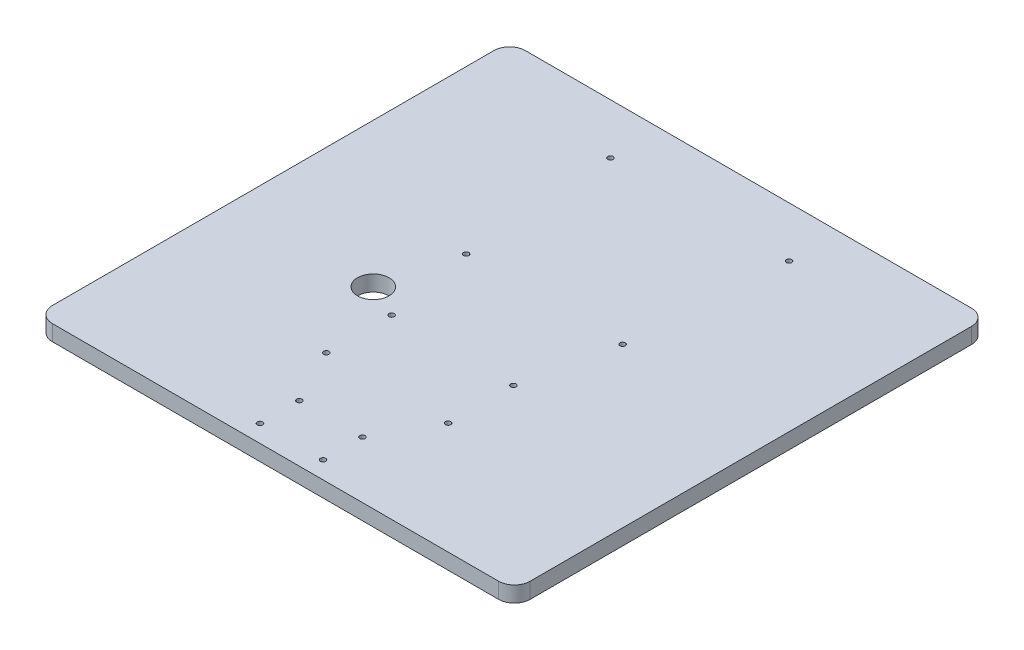
ISO-10303-21;
HEADER;
FILE_DESCRIPTION(('STEP AP214'),'2;1');
FILE_NAME('part.step','',(''),(''),'','','');
FILE_SCHEMA(('AUTOMOTIVE_DESIGN { 1 0 10303 214 1 1 1 1 }'));
ENDSEC;
DATA;
#1=APPLICATION_CONTEXT('core data for automotive mechanical design processes');
#2=APPLICATION_PROTOCOL_DEFINITION('international standard','automotive_design',2000,#1);
#3=PRODUCT_CONTEXT('',#1,'mechanical');
#4=PRODUCT('Part','Part','',(#3));
#5=PRODUCT_RELATED_PRODUCT_CATEGORY('part','',(#4));
#6=PRODUCT_DEFINITION_FORMATION('','',#4);
#7=PRODUCT_DEFINITION_CONTEXT('part definition',#1,'design');
#8=PRODUCT_DEFINITION('design','',#6,#7);
#9=PRODUCT_DEFINITION_SHAPE('','',#8);
#10=(LENGTH_UNIT() NAMED_UNIT(*) SI_UNIT(.MILLI.,.METRE.));
#11=(NAMED_UNIT(*) PLANE_ANGLE_UNIT() SI_UNIT($,.RADIAN.));
#12=(NAMED_UNIT(*) SI_UNIT($,.STERADIAN.) SOLID_ANGLE_UNIT());
#13=UNCERTAINTY_MEASURE_WITH_UNIT(LENGTH_MEASURE(1.E-05),#10,'distance_accuracy_value','');
#14=(GEOMETRIC_REPRESENTATION_CONTEXT(3) GLOBAL_UNCERTAINTY_ASSIGNED_CONTEXT((#13)) GLOBAL_UNIT_ASSIGNED_CONTEXT((#10,
#11,#12)) REPRESENTATION_CONTEXT('',''));
#15=CARTESIAN_POINT('',(0.,0.,0.));
#16=DIRECTION('',(0.,0.,1.));
#17=DIRECTION('',(1.,0.,0.));
#18=AXIS2_PLACEMENT_3D('',#15,#16,#17);
#19=CARTESIAN_POINT('',(0.,-10.,0.));
#20=DIRECTION('',(-1.,0.,0.));
#21=DIRECTION('',(0.,0.,1.));
#22=AXIS2_PLACEMENT_3D('',#19,#20,#21);
#23=PLANE('',#22);
#24=DIRECTION('',(0.,0.,1.));
#25=VECTOR('',#24,1.);
#26=CARTESIAN_POINT('',(0.,-10.,0.));
#27=LINE('',#26,#25);
#28=CARTESIAN_POINT('',(0.,-10.,-290.));
#29=VERTEX_POINT('',#28);
#30=CARTESIAN_POINT('',(0.,-10.,-10.));
#31=VERTEX_POINT('',#30);
#32=EDGE_CURVE('E161',#29,#31,#27,.T.);
#33=ORIENTED_EDGE('',*,*,#32,.T.);
#34=DIRECTION('',(0.,1.,0.));
#35=VECTOR('',#34,1.);
#36=CARTESIAN_POINT('',(0.,-10.,-10.));
#37=LINE('',#36,#35);
#38=CARTESIAN_POINT('',(0.,0.,-10.));
#39=VERTEX_POINT('',#38);
#40=EDGE_CURVE('E154',#31,#39,#37,.T.);
#41=ORIENTED_EDGE('',*,*,#40,.T.);
#42=DIRECTION('',(0.,0.,1.));
#43=VECTOR('',#42,1.);
#44=CARTESIAN_POINT('',(0.,0.,0.));
#45=LINE('',#44,#43);
#46=CARTESIAN_POINT('',(0.,0.,-290.));
#47=VERTEX_POINT('',#46);
#48=EDGE_CURVE('E107',#47,#39,#45,.T.);
#49=ORIENTED_EDGE('',*,*,#48,.F.);
#50=DIRECTION('',(0.,1.,0.));
#51=VECTOR('',#50,1.);
#52=CARTESIAN_POINT('',(0.,-10.,-290.));
#53=LINE('',#52,#51);
#54=EDGE_CURVE('E152',#47,#29,#53,.F.);
#55=ORIENTED_EDGE('',*,*,#54,.T.);
#56=EDGE_LOOP('',(#33,#41,#49,#55));
#57=FACE_BOUND('',#56,.T.);
#58=ADVANCED_FACE('F37',(#57),#23,.T.);
#59=CARTESIAN_POINT('',(0.,-10.,-300.));
#60=DIRECTION('',(0.,0.,-1.));
#61=DIRECTION('',(-1.,0.,0.));
#62=AXIS2_PLACEMENT_3D('',#59,#60,#61);
#63=PLANE('',#62);
#64=DIRECTION('',(-1.,0.,0.));
#65=VECTOR('',#64,1.);
#66=CARTESIAN_POINT('',(0.,0.,-300.));
#67=LINE('',#66,#65);
#68=CARTESIAN_POINT('',(293.,0.,-300.));
#69=VERTEX_POINT('',#68);
#70=CARTESIAN_POINT('',(10.,0.,-300.));
#71=VERTEX_POINT('',#70);
#72=EDGE_CURVE('E135',#69,#71,#67,.T.);
#73=ORIENTED_EDGE('',*,*,#72,.F.);
#74=DIRECTION('',(0.,1.,0.));
#75=VECTOR('',#74,1.);
#76=CARTESIAN_POINT('',(293.,-10.,-300.));
#77=LINE('',#76,#75);
#78=CARTESIAN_POINT('',(293.,-10.,-300.));
#79=VERTEX_POINT('',#78);
#80=EDGE_CURVE('E11',#69,#79,#77,.F.);
#81=ORIENTED_EDGE('',*,*,#80,.T.);
#82=DIRECTION('',(-1.,0.,0.));
#83=VECTOR('',#82,1.);
#84=CARTESIAN_POINT('',(0.,-10.,-300.));
#85=LINE('',#84,#83);
#86=CARTESIAN_POINT('',(10.,-10.,-300.));
#87=VERTEX_POINT('',#86);
#88=EDGE_CURVE('E128',#79,#87,#85,.T.);
#89=ORIENTED_EDGE('',*,*,#88,.T.);
#90=DIRECTION('',(0.,1.,0.));
#91=VECTOR('',#90,1.);
#92=CARTESIAN_POINT('',(10.,-10.,-300.));
#93=LINE('',#92,#91);
#94=EDGE_CURVE('E45',#87,#71,#93,.T.);
#95=ORIENTED_EDGE('',*,*,#94,.T.);
#96=EDGE_LOOP('',(#73,#81,#89,#95));
#97=FACE_BOUND('',#96,.T.);
#98=ADVANCED_FACE('F158',(#97),#63,.T.);
#99=CARTESIAN_POINT('',(303.,-10.,0.));
#100=DIRECTION('',(1.,0.,0.));
#101=DIRECTION('',(0.,0.,-1.));
#102=AXIS2_PLACEMENT_3D('',#99,#100,#101);
#103=PLANE('',#102);
#104=DIRECTION('',(0.,0.,-1.));
#105=VECTOR('',#104,1.);
#106=CARTESIAN_POINT('',(303.,0.,0.));
#107=LINE('',#106,#105);
#108=CARTESIAN_POINT('',(303.,0.,-10.));
#109=VERTEX_POINT('',#108);
#110=CARTESIAN_POINT('',(303.,0.,-290.));
#111=VERTEX_POINT('',#110);
#112=EDGE_CURVE('E123',#109,#111,#107,.T.);
#113=ORIENTED_EDGE('',*,*,#112,.F.);
#114=DIRECTION('',(0.,1.,0.));
#115=VECTOR('',#114,1.);
#116=CARTESIAN_POINT('',(303.,-10.,-10.));
#117=LINE('',#116,#115);
#118=CARTESIAN_POINT('',(303.,-10.,-10.));
#119=VERTEX_POINT('',#118);
#120=EDGE_CURVE('E144',#109,#119,#117,.F.);
#121=ORIENTED_EDGE('',*,*,#120,.T.);
#122=DIRECTION('',(0.,0.,-1.));
#123=VECTOR('',#122,1.);
#124=CARTESIAN_POINT('',(303.,-10.,0.));
#125=LINE('',#124,#123);
#126=CARTESIAN_POINT('',(303.,-10.,-290.));
#127=VERTEX_POINT('',#126);
#128=EDGE_CURVE('E132',#119,#127,#125,.T.);
#129=ORIENTED_EDGE('',*,*,#128,.T.);
#130=DIRECTION('',(0.,1.,0.));
#131=VECTOR('',#130,1.);
#132=CARTESIAN_POINT('',(303.,-10.,-290.));
#133=LINE('',#132,#131);
#134=EDGE_CURVE('E141',#127,#111,#133,.T.);
#135=ORIENTED_EDGE('',*,*,#134,.T.);
#136=EDGE_LOOP('',(#113,#121,#129,#135));
#137=FACE_BOUND('',#136,.T.);
#138=ADVANCED_FACE('F301',(#137),#103,.T.);
#139=CARTESIAN_POINT('',(0.,-10.,0.));
#140=DIRECTION('',(0.,0.,1.));
#141=DIRECTION('',(1.,0.,0.));
#142=AXIS2_PLACEMENT_3D('',#139,#140,#141);
#143=PLANE('',#142);
#144=DIRECTION('',(1.,0.,0.));
#145=VECTOR('',#144,1.);
#146=CARTESIAN_POINT('',(0.,-10.,0.));
#147=LINE('',#146,#145);
#148=CARTESIAN_POINT('',(10.,-10.,0.));
#149=VERTEX_POINT('',#148);
#150=CARTESIAN_POINT('',(293.,-10.,0.));
#151=VERTEX_POINT('',#150);
#152=EDGE_CURVE('E163',#149,#151,#147,.T.);
#153=ORIENTED_EDGE('',*,*,#152,.T.);
#154=DIRECTION('',(0.,1.,0.));
#155=VECTOR('',#154,1.);
#156=CARTESIAN_POINT('',(293.,-10.,0.));
#157=LINE('',#156,#155);
#158=CARTESIAN_POINT('',(293.,0.,0.));
#159=VERTEX_POINT('',#158);
#160=EDGE_CURVE('E122',#151,#159,#157,.T.);
#161=ORIENTED_EDGE('',*,*,#160,.T.);
#162=DIRECTION('',(1.,0.,0.));
#163=VECTOR('',#162,1.);
#164=CARTESIAN_POINT('',(0.,0.,0.));
#165=LINE('',#164,#163);
#166=CARTESIAN_POINT('',(10.,0.,0.));
#167=VERTEX_POINT('',#166);
#168=EDGE_CURVE('E105',#167,#159,#165,.T.);
#169=ORIENTED_EDGE('',*,*,#168,.F.);
#170=DIRECTION('',(0.,1.,0.));
#171=VECTOR('',#170,1.);
#172=CARTESIAN_POINT('',(10.,-10.,0.));
#173=LINE('',#172,#171);
#174=EDGE_CURVE('E119',#167,#149,#173,.F.);
#175=ORIENTED_EDGE('',*,*,#174,.T.);
#176=EDGE_LOOP('',(#153,#161,#169,#175));
#177=FACE_BOUND('',#176,.T.);
#178=ADVANCED_FACE('F118',(#177),#143,.T.);
#179=CARTESIAN_POINT('',(0.,-10.,0.));
#180=DIRECTION('',(0.,-1.,0.));
#181=DIRECTION('',(0.,0.,-1.));
#182=AXIS2_PLACEMENT_3D('',#179,#180,#181);
#183=PLANE('',#182);
#184=CARTESIAN_POINT('',(190.149999999997,-10.,-70.8519999999986));
#185=DIRECTION('',(0.,-1.,0.));
#186=DIRECTION('',(0.,0.,-1.));
#187=AXIS2_PLACEMENT_3D('',#184,#185,#186);
#188=CIRCLE('',#187,1.69999999999998);
#189=CARTESIAN_POINT('',(190.149999999997,-10.,-72.5519999999986));
#190=VERTEX_POINT('',#189);
#191=EDGE_CURVE('E243',#190,#190,#188,.T.);
#192=ORIENTED_EDGE('',*,*,#191,.F.);
#193=EDGE_LOOP('',(#192));
#194=FACE_BOUND('',#193,.T.);
#195=CARTESIAN_POINT('',(190.149999999998,-10.,-112.247999999999));
#196=DIRECTION('',(0.,-1.,0.));
#197=DIRECTION('',(0.,0.,-1.));
#198=AXIS2_PLACEMENT_3D('',#195,#196,#197);
#199=CIRCLE('',#198,1.69999999999998);
#200=CARTESIAN_POINT('',(190.149999999998,-10.,-113.947999999999));
#201=VERTEX_POINT('',#200);
#202=EDGE_CURVE('E237',#201,#201,#199,.T.);
#203=ORIENTED_EDGE('',*,*,#202,.F.);
#204=EDGE_LOOP('',(#203));
#205=FACE_BOUND('',#204,.T.);
#206=CARTESIAN_POINT('',(112.859999999997,-10.,-70.8519999999991));
#207=DIRECTION('',(0.,-1.,0.));
#208=DIRECTION('',(0.,0.,-1.));
#209=AXIS2_PLACEMENT_3D('',#206,#207,#208);
#210=CIRCLE('',#209,1.69999999999999);
#211=CARTESIAN_POINT('',(112.859999999997,-10.,-72.5519999999991));
#212=VERTEX_POINT('',#211);
#213=EDGE_CURVE('E231',#212,#212,#210,.T.);
#214=ORIENTED_EDGE('',*,*,#213,.F.);
#215=EDGE_LOOP('',(#214));
#216=FACE_BOUND('',#215,.T.);
#217=CARTESIAN_POINT('',(112.859999999997,-10.,-112.248));
#218=DIRECTION('',(0.,-1.,0.));
#219=DIRECTION('',(0.,0.,-1.));
#220=AXIS2_PLACEMENT_3D('',#217,#218,#219);
#221=CIRCLE('',#220,1.69999999999999);
#222=CARTESIAN_POINT('',(112.859999999997,-10.,-113.948));
#223=VERTEX_POINT('',#222);
#224=EDGE_CURVE('E223',#223,#223,#221,.T.);
#225=ORIENTED_EDGE('',*,*,#224,.F.);
#226=EDGE_LOOP('',(#225));
#227=FACE_BOUND('',#226,.T.);
#228=CARTESIAN_POINT('',(91.5,-10.,-122.));
#229=DIRECTION('',(0.,1.,0.));
#230=DIRECTION('',(0.,0.,1.));
#231=AXIS2_PLACEMENT_3D('',#228,#229,#230);
#232=CIRCLE('',#231,9.99999999999998);
#233=CARTESIAN_POINT('',(91.5,-10.,-112.));
#234=VERTEX_POINT('',#233);
#235=EDGE_CURVE('E219',#234,#234,#232,.T.);
#236=ORIENTED_EDGE('',*,*,#235,.T.);
#237=EDGE_LOOP('',(#236));
#238=FACE_BOUND('',#237,.T.);
#239=CARTESIAN_POINT('',(130.625,-10.,-11.));
#240=DIRECTION('',(0.,-1.,0.));
#241=DIRECTION('',(0.,0.,-1.));
#242=AXIS2_PLACEMENT_3D('',#239,#240,#241);
#243=CIRCLE('',#242,1.69999999999998);
#244=CARTESIAN_POINT('',(130.625,-10.,-12.7));
#245=VERTEX_POINT('',#244);
#246=EDGE_CURVE('E213',#245,#245,#243,.T.);
#247=ORIENTED_EDGE('',*,*,#246,.F.);
#248=EDGE_LOOP('',(#247));
#249=FACE_BOUND('',#248,.T.);
#250=CARTESIAN_POINT('',(170.625,-10.,-11.));
#251=DIRECTION('',(0.,-1.,0.));
#252=DIRECTION('',(0.,0.,-1.));
#253=AXIS2_PLACEMENT_3D('',#250,#251,#252);
#254=CIRCLE('',#253,1.69999999999998);
#255=CARTESIAN_POINT('',(170.625,-10.,-12.7));
#256=VERTEX_POINT('',#255);
#257=EDGE_CURVE('E207',#256,#256,#254,.T.);
#258=ORIENTED_EDGE('',*,*,#257,.F.);
#259=EDGE_LOOP('',(#258));
#260=FACE_BOUND('',#259,.T.);
#261=CARTESIAN_POINT('',(130.625,-10.,-36.));
#262=DIRECTION('',(0.,-1.,0.));
#263=DIRECTION('',(0.,0.,-1.));
#264=AXIS2_PLACEMENT_3D('',#261,#262,#263);
#265=CIRCLE('',#264,1.69999999999998);
#266=CARTESIAN_POINT('',(130.625,-10.,-37.7));
#267=VERTEX_POINT('',#266);
#268=EDGE_CURVE('E201',#267,#267,#265,.T.);
#269=ORIENTED_EDGE('',*,*,#268,.F.);
#270=EDGE_LOOP('',(#269));
#271=FACE_BOUND('',#270,.T.);
#272=CARTESIAN_POINT('',(170.625,-10.,-36.));
#273=DIRECTION('',(0.,-1.,0.));
#274=DIRECTION('',(0.,0.,-1.));
#275=AXIS2_PLACEMENT_3D('',#272,#273,#274);
#276=CIRCLE('',#275,1.69999999999998);
#277=CARTESIAN_POINT('',(170.625,-10.,-37.7));
#278=VERTEX_POINT('',#277);
#279=EDGE_CURVE('E195',#278,#278,#276,.T.);
#280=ORIENTED_EDGE('',*,*,#279,.F.);
#281=EDGE_LOOP('',(#280));
#282=FACE_BOUND('',#281,.T.);
#283=CARTESIAN_POINT('',(202.2366,-10.,-169.469739332807));
#284=DIRECTION('',(0.,-1.,0.));
#285=DIRECTION('',(0.,0.,-1.));
#286=AXIS2_PLACEMENT_3D('',#283,#284,#285);
#287=CIRCLE('',#286,1.69999999999998);
#288=CARTESIAN_POINT('',(202.2366,-10.,-171.169739332807));
#289=VERTEX_POINT('',#288);
#290=EDGE_CURVE('E189',#289,#289,#287,.T.);
#291=ORIENTED_EDGE('',*,*,#290,.F.);
#292=EDGE_LOOP('',(#291));
#293=FACE_BOUND('',#292,.T.);
#294=CARTESIAN_POINT('',(102.9732,-10.,-169.469739332807));
#295=DIRECTION('',(0.,-1.,0.));
#296=DIRECTION('',(0.,0.,-1.));
#297=AXIS2_PLACEMENT_3D('',#294,#295,#296);
#298=CIRCLE('',#297,1.69999999999999);
#299=CARTESIAN_POINT('',(102.9732,-10.,-171.169739332807));
#300=VERTEX_POINT('',#299);
#301=EDGE_CURVE('E183',#300,#300,#298,.T.);
#302=ORIENTED_EDGE('',*,*,#301,.F.);
#303=EDGE_LOOP('',(#302));
#304=FACE_BOUND('',#303,.T.);
#305=CARTESIAN_POINT('',(95.9732,-10.,-267.996539332807));
#306=DIRECTION('',(0.,-1.,0.));
#307=DIRECTION('',(0.,0.,-1.));
#308=AXIS2_PLACEMENT_3D('',#305,#306,#307);
#309=CIRCLE('',#308,1.69999999999999);
#310=CARTESIAN_POINT('',(95.9732,-10.,-269.696539332807));
#311=VERTEX_POINT('',#310);
#312=EDGE_CURVE('E177',#311,#311,#309,.T.);
#313=ORIENTED_EDGE('',*,*,#312,.F.);
#314=EDGE_LOOP('',(#313));
#315=FACE_BOUND('',#314,.T.);
#316=CARTESIAN_POINT('',(209.2366,-10.,-267.996539332807));
#317=DIRECTION('',(0.,-1.,0.));
#318=DIRECTION('',(0.,0.,-1.));
#319=AXIS2_PLACEMENT_3D('',#316,#317,#318);
#320=CIRCLE('',#319,1.69999999999998);
#321=CARTESIAN_POINT('',(209.2366,-10.,-269.696539332807));
#322=VERTEX_POINT('',#321);
#323=EDGE_CURVE('E167',#322,#322,#320,.T.);
#324=ORIENTED_EDGE('',*,*,#323,.F.);
#325=EDGE_LOOP('',(#324));
#326=FACE_BOUND('',#325,.T.);
#327=ORIENTED_EDGE('',*,*,#128,.F.);
#328=CARTESIAN_POINT('',(293.,-10.,-10.));
#329=DIRECTION('',(0.,-1.,0.));
#330=DIRECTION('',(0.,0.,-1.));
#331=AXIS2_PLACEMENT_3D('',#328,#329,#330);
#332=CIRCLE('',#331,10.);
#333=EDGE_CURVE('E150',#119,#151,#332,.T.);
#334=ORIENTED_EDGE('',*,*,#333,.T.);
#335=ORIENTED_EDGE('',*,*,#152,.F.);
#336=CARTESIAN_POINT('',(10.,-10.,-10.));
#337=DIRECTION('',(0.,-1.,0.));
#338=DIRECTION('',(0.,0.,-1.));
#339=AXIS2_PLACEMENT_3D('',#336,#337,#338);
#340=CIRCLE('',#339,10.);
#341=EDGE_CURVE('E127',#149,#31,#340,.T.);
#342=ORIENTED_EDGE('',*,*,#341,.T.);
#343=ORIENTED_EDGE('',*,*,#32,.F.);
#344=CARTESIAN_POINT('',(10.,-10.,-290.));
#345=DIRECTION('',(0.,-1.,0.));
#346=DIRECTION('',(0.,0.,-1.));
#347=AXIS2_PLACEMENT_3D('',#344,#345,#346);
#348=CIRCLE('',#347,10.);
#349=EDGE_CURVE('E52',#29,#87,#348,.T.);
#350=ORIENTED_EDGE('',*,*,#349,.T.);
#351=ORIENTED_EDGE('',*,*,#88,.F.);
#352=CARTESIAN_POINT('',(293.,-10.,-290.));
#353=DIRECTION('',(0.,-1.,0.));
#354=DIRECTION('',(0.,0.,-1.));
#355=AXIS2_PLACEMENT_3D('',#352,#353,#354);
#356=CIRCLE('',#355,10.);
#357=EDGE_CURVE('E147',#79,#127,#356,.T.);
#358=ORIENTED_EDGE('',*,*,#357,.T.);
#359=EDGE_LOOP('',(#327,#334,#335,#342,#343,#350,#351,#358));
#360=FACE_BOUND('',#359,.T.);
#361=ADVANCED_FACE('F255',(#194,#205,#216,#227,#238,#249,#260,#271,#282,#293,#304,#315,#326,
#360),#183,.T.);
#362=CARTESIAN_POINT('',(0.,0.,0.));
#363=DIRECTION('',(0.,-1.,0.));
#364=DIRECTION('',(0.,0.,-1.));
#365=AXIS2_PLACEMENT_3D('',#362,#363,#364);
#366=PLANE('',#365);
#367=CARTESIAN_POINT('',(190.149999999997,0.,-70.8519999999986));
#368=DIRECTION('',(0.,1.,0.));
#369=DIRECTION('',(0.,0.,1.));
#370=AXIS2_PLACEMENT_3D('',#367,#368,#369);
#371=CIRCLE('',#370,1.69999999999998);
#372=CARTESIAN_POINT('',(190.149999999997,0.,-69.1519999999986));
#373=VERTEX_POINT('',#372);
#374=EDGE_CURVE('E246',#373,#373,#371,.T.);
#375=ORIENTED_EDGE('',*,*,#374,.F.);
#376=EDGE_LOOP('',(#375));
#377=FACE_BOUND('',#376,.T.);
#378=CARTESIAN_POINT('',(190.149999999998,0.,-112.247999999999));
#379=DIRECTION('',(0.,1.,0.));
#380=DIRECTION('',(0.,0.,1.));
#381=AXIS2_PLACEMENT_3D('',#378,#379,#380);
#382=CIRCLE('',#381,1.69999999999998);
#383=CARTESIAN_POINT('',(190.149999999998,0.,-110.547999999999));
#384=VERTEX_POINT('',#383);
#385=EDGE_CURVE('E240',#384,#384,#382,.T.);
#386=ORIENTED_EDGE('',*,*,#385,.F.);
#387=EDGE_LOOP('',(#386));
#388=FACE_BOUND('',#387,.T.);
#389=CARTESIAN_POINT('',(112.859999999997,0.,-70.8519999999991));
#390=DIRECTION('',(0.,1.,0.));
#391=DIRECTION('',(0.,0.,1.));
#392=AXIS2_PLACEMENT_3D('',#389,#390,#391);
#393=CIRCLE('',#392,1.69999999999999);
#394=CARTESIAN_POINT('',(112.859999999997,0.,-69.1519999999991));
#395=VERTEX_POINT('',#394);
#396=EDGE_CURVE('E234',#395,#395,#393,.T.);
#397=ORIENTED_EDGE('',*,*,#396,.F.);
#398=EDGE_LOOP('',(#397));
#399=FACE_BOUND('',#398,.T.);
#400=CARTESIAN_POINT('',(112.859999999997,0.,-112.248));
#401=DIRECTION('',(0.,1.,0.));
#402=DIRECTION('',(0.,0.,1.));
#403=AXIS2_PLACEMENT_3D('',#400,#401,#402);
#404=CIRCLE('',#403,1.69999999999999);
#405=CARTESIAN_POINT('',(112.859999999997,0.,-110.548));
#406=VERTEX_POINT('',#405);
#407=EDGE_CURVE('E228',#406,#406,#404,.T.);
#408=ORIENTED_EDGE('',*,*,#407,.F.);
#409=EDGE_LOOP('',(#408));
#410=FACE_BOUND('',#409,.T.);
#411=CARTESIAN_POINT('',(91.5,0.,-122.));
#412=DIRECTION('',(0.,1.,0.));
#413=DIRECTION('',(0.,0.,1.));
#414=AXIS2_PLACEMENT_3D('',#411,#412,#413);
#415=CIRCLE('',#414,9.99999999999998);
#416=CARTESIAN_POINT('',(91.5,0.,-112.));
#417=VERTEX_POINT('',#416);
#418=EDGE_CURVE('E220',#417,#417,#415,.T.);
#419=ORIENTED_EDGE('',*,*,#418,.F.);
#420=EDGE_LOOP('',(#419));
#421=FACE_BOUND('',#420,.T.);
#422=CARTESIAN_POINT('',(130.625,0.,-11.));
#423=DIRECTION('',(0.,1.,0.));
#424=DIRECTION('',(0.,0.,1.));
#425=AXIS2_PLACEMENT_3D('',#422,#423,#424);
#426=CIRCLE('',#425,1.69999999999998);
#427=CARTESIAN_POINT('',(130.625,0.,-9.30000000000003));
#428=VERTEX_POINT('',#427);
#429=EDGE_CURVE('E216',#428,#428,#426,.T.);
#430=ORIENTED_EDGE('',*,*,#429,.F.);
#431=EDGE_LOOP('',(#430));
#432=FACE_BOUND('',#431,.T.);
#433=CARTESIAN_POINT('',(170.625,0.,-11.));
#434=DIRECTION('',(0.,1.,0.));
#435=DIRECTION('',(0.,0.,1.));
#436=AXIS2_PLACEMENT_3D('',#433,#434,#435);
#437=CIRCLE('',#436,1.69999999999998);
#438=CARTESIAN_POINT('',(170.625,0.,-9.30000000000003));
#439=VERTEX_POINT('',#438);
#440=EDGE_CURVE('E210',#439,#439,#437,.T.);
#441=ORIENTED_EDGE('',*,*,#440,.F.);
#442=EDGE_LOOP('',(#441));
#443=FACE_BOUND('',#442,.T.);
#444=CARTESIAN_POINT('',(130.625,0.,-36.));
#445=DIRECTION('',(0.,1.,0.));
#446=DIRECTION('',(0.,0.,1.));
#447=AXIS2_PLACEMENT_3D('',#444,#445,#446);
#448=CIRCLE('',#447,1.69999999999998);
#449=CARTESIAN_POINT('',(130.625,0.,-34.3));
#450=VERTEX_POINT('',#449);
#451=EDGE_CURVE('E204',#450,#450,#448,.T.);
#452=ORIENTED_EDGE('',*,*,#451,.F.);
#453=EDGE_LOOP('',(#452));
#454=FACE_BOUND('',#453,.T.);
#455=CARTESIAN_POINT('',(170.625,0.,-36.));
#456=DIRECTION('',(0.,1.,0.));
#457=DIRECTION('',(0.,0.,1.));
#458=AXIS2_PLACEMENT_3D('',#455,#456,#457);
#459=CIRCLE('',#458,1.69999999999998);
#460=CARTESIAN_POINT('',(170.625,0.,-34.3));
#461=VERTEX_POINT('',#460);
#462=EDGE_CURVE('E198',#461,#461,#459,.T.);
#463=ORIENTED_EDGE('',*,*,#462,.F.);
#464=EDGE_LOOP('',(#463));
#465=FACE_BOUND('',#464,.T.);
#466=CARTESIAN_POINT('',(202.2366,0.,-169.469739332807));
#467=DIRECTION('',(0.,1.,0.));
#468=DIRECTION('',(0.,0.,1.));
#469=AXIS2_PLACEMENT_3D('',#466,#467,#468);
#470=CIRCLE('',#469,1.69999999999998);
#471=CARTESIAN_POINT('',(202.2366,0.,-167.769739332807));
#472=VERTEX_POINT('',#471);
#473=EDGE_CURVE('E192',#472,#472,#470,.T.);
#474=ORIENTED_EDGE('',*,*,#473,.F.);
#475=EDGE_LOOP('',(#474));
#476=FACE_BOUND('',#475,.T.);
#477=CARTESIAN_POINT('',(102.9732,0.,-169.469739332807));
#478=DIRECTION('',(0.,1.,0.));
#479=DIRECTION('',(0.,0.,1.));
#480=AXIS2_PLACEMENT_3D('',#477,#478,#479);
#481=CIRCLE('',#480,1.69999999999999);
#482=CARTESIAN_POINT('',(102.9732,0.,-167.769739332807));
#483=VERTEX_POINT('',#482);
#484=EDGE_CURVE('E186',#483,#483,#481,.T.);
#485=ORIENTED_EDGE('',*,*,#484,.F.);
#486=EDGE_LOOP('',(#485));
#487=FACE_BOUND('',#486,.T.);
#488=CARTESIAN_POINT('',(95.9732,0.,-267.996539332807));
#489=DIRECTION('',(0.,1.,0.));
#490=DIRECTION('',(0.,0.,1.));
#491=AXIS2_PLACEMENT_3D('',#488,#489,#490);
#492=CIRCLE('',#491,1.69999999999999);
#493=CARTESIAN_POINT('',(95.9732,0.,-266.296539332807));
#494=VERTEX_POINT('',#493);
#495=EDGE_CURVE('E180',#494,#494,#492,.T.);
#496=ORIENTED_EDGE('',*,*,#495,.F.);
#497=EDGE_LOOP('',(#496));
#498=FACE_BOUND('',#497,.T.);
#499=CARTESIAN_POINT('',(209.2366,0.,-267.996539332807));
#500=DIRECTION('',(0.,1.,0.));
#501=DIRECTION('',(0.,0.,1.));
#502=AXIS2_PLACEMENT_3D('',#499,#500,#501);
#503=CIRCLE('',#502,1.69999999999998);
#504=CARTESIAN_POINT('',(209.2366,0.,-266.296539332807));
#505=VERTEX_POINT('',#504);
#506=EDGE_CURVE('E174',#505,#505,#503,.T.);
#507=ORIENTED_EDGE('',*,*,#506,.F.);
#508=EDGE_LOOP('',(#507));
#509=FACE_BOUND('',#508,.T.);
#510=ORIENTED_EDGE('',*,*,#168,.T.);
#511=CARTESIAN_POINT('',(293.,0.,-10.));
#512=DIRECTION('',(0.,-1.,0.));
#513=DIRECTION('',(0.,0.,-1.));
#514=AXIS2_PLACEMENT_3D('',#511,#512,#513);
#515=CIRCLE('',#514,10.);
#516=EDGE_CURVE('E112',#159,#109,#515,.F.);
#517=ORIENTED_EDGE('',*,*,#516,.T.);
#518=ORIENTED_EDGE('',*,*,#112,.T.);
#519=CARTESIAN_POINT('',(293.,0.,-290.));
#520=DIRECTION('',(0.,-1.,0.));
#521=DIRECTION('',(0.,0.,-1.));
#522=AXIS2_PLACEMENT_3D('',#519,#520,#521);
#523=CIRCLE('',#522,10.);
#524=EDGE_CURVE('E113',#111,#69,#523,.F.);
#525=ORIENTED_EDGE('',*,*,#524,.T.);
#526=ORIENTED_EDGE('',*,*,#72,.T.);
#527=CARTESIAN_POINT('',(10.,0.,-290.));
#528=DIRECTION('',(0.,-1.,0.));
#529=DIRECTION('',(0.,0.,-1.));
#530=AXIS2_PLACEMENT_3D('',#527,#528,#529);
#531=CIRCLE('',#530,10.);
#532=EDGE_CURVE('E130',#71,#47,#531,.F.);
#533=ORIENTED_EDGE('',*,*,#532,.T.);
#534=ORIENTED_EDGE('',*,*,#48,.T.);
#535=CARTESIAN_POINT('',(10.,0.,-10.));
#536=DIRECTION('',(0.,-1.,0.));
#537=DIRECTION('',(0.,0.,-1.));
#538=AXIS2_PLACEMENT_3D('',#535,#536,#537);
#539=CIRCLE('',#538,10.);
#540=EDGE_CURVE('E102',#39,#167,#539,.F.);
#541=ORIENTED_EDGE('',*,*,#540,.T.);
#542=EDGE_LOOP('',(#510,#517,#518,#525,#526,#533,#534,#541));
#543=FACE_BOUND('',#542,.T.);
#544=ADVANCED_FACE('F104',(#377,#388,#399,#410,#421,#432,#443,#454,#465,#476,#487,#498,#509,
#543),#366,.F.);
#545=CARTESIAN_POINT('',(293.,-10.,-10.));
#546=DIRECTION('',(0.,1.,0.));
#547=DIRECTION('',(0.,0.,1.));
#548=AXIS2_PLACEMENT_3D('',#545,#546,#547);
#549=CYLINDRICAL_SURFACE('',#548,10.);
#550=ORIENTED_EDGE('',*,*,#333,.F.);
#551=ORIENTED_EDGE('',*,*,#120,.F.);
#552=ORIENTED_EDGE('',*,*,#516,.F.);
#553=ORIENTED_EDGE('',*,*,#160,.F.);
#554=EDGE_LOOP('',(#550,#551,#552,#553));
#555=FACE_BOUND('',#554,.T.);
#556=ADVANCED_FACE('F254',(#555),#549,.T.);
#557=CARTESIAN_POINT('',(10.,-10.,-10.));
#558=DIRECTION('',(0.,1.,0.));
#559=DIRECTION('',(0.,0.,1.));
#560=AXIS2_PLACEMENT_3D('',#557,#558,#559);
#561=CYLINDRICAL_SURFACE('',#560,10.);
#562=ORIENTED_EDGE('',*,*,#341,.F.);
#563=ORIENTED_EDGE('',*,*,#174,.F.);
#564=ORIENTED_EDGE('',*,*,#540,.F.);
#565=ORIENTED_EDGE('',*,*,#40,.F.);
#566=EDGE_LOOP('',(#562,#563,#564,#565));
#567=FACE_BOUND('',#566,.T.);
#568=ADVANCED_FACE('F126',(#567),#561,.T.);
#569=CARTESIAN_POINT('',(293.,-10.,-290.));
#570=DIRECTION('',(0.,1.,0.));
#571=DIRECTION('',(0.,0.,1.));
#572=AXIS2_PLACEMENT_3D('',#569,#570,#571);
#573=CYLINDRICAL_SURFACE('',#572,10.);
#574=ORIENTED_EDGE('',*,*,#357,.F.);
#575=ORIENTED_EDGE('',*,*,#80,.F.);
#576=ORIENTED_EDGE('',*,*,#524,.F.);
#577=ORIENTED_EDGE('',*,*,#134,.F.);
#578=EDGE_LOOP('',(#574,#575,#576,#577));
#579=FACE_BOUND('',#578,.T.);
#580=ADVANCED_FACE('F293',(#579),#573,.T.);
#581=CARTESIAN_POINT('',(10.,-10.,-290.));
#582=DIRECTION('',(0.,1.,0.));
#583=DIRECTION('',(0.,0.,1.));
#584=AXIS2_PLACEMENT_3D('',#581,#582,#583);
#585=CYLINDRICAL_SURFACE('',#584,10.);
#586=ORIENTED_EDGE('',*,*,#349,.F.);
#587=ORIENTED_EDGE('',*,*,#54,.F.);
#588=ORIENTED_EDGE('',*,*,#532,.F.);
#589=ORIENTED_EDGE('',*,*,#94,.F.);
#590=EDGE_LOOP('',(#586,#587,#588,#589));
#591=FACE_BOUND('',#590,.T.);
#592=ADVANCED_FACE('F39',(#591),#585,.T.);
#593=CARTESIAN_POINT('',(209.2366,0.,-267.996539332807));
#594=DIRECTION('',(0.,1.,0.));
#595=DIRECTION('',(0.,0.,1.));
#596=AXIS2_PLACEMENT_3D('',#593,#594,#595);
#597=CYLINDRICAL_SURFACE('',#596,1.69999999999998);
#598=ORIENTED_EDGE('',*,*,#323,.T.);
#599=EDGE_LOOP('',(#598));
#600=FACE_BOUND('',#599,.T.);
#601=ORIENTED_EDGE('',*,*,#506,.T.);
#602=EDGE_LOOP('',(#601));
#603=FACE_BOUND('',#602,.T.);
#604=ADVANCED_FACE('F281',(#600,#603),#597,.F.);
#605=CARTESIAN_POINT('',(95.9732,0.,-267.996539332807));
#606=DIRECTION('',(0.,1.,0.));
#607=DIRECTION('',(0.,0.,1.));
#608=AXIS2_PLACEMENT_3D('',#605,#606,#607);
#609=CYLINDRICAL_SURFACE('',#608,1.69999999999999);
#610=ORIENTED_EDGE('',*,*,#312,.T.);
#611=EDGE_LOOP('',(#610));
#612=FACE_BOUND('',#611,.T.);
#613=ORIENTED_EDGE('',*,*,#495,.T.);
#614=EDGE_LOOP('',(#613));
#615=FACE_BOUND('',#614,.T.);
#616=ADVANCED_FACE('F283',(#612,#615),#609,.F.);
#617=CARTESIAN_POINT('',(102.9732,0.,-169.469739332807));
#618=DIRECTION('',(0.,1.,0.));
#619=DIRECTION('',(0.,0.,1.));
#620=AXIS2_PLACEMENT_3D('',#617,#618,#619);
#621=CYLINDRICAL_SURFACE('',#620,1.69999999999999);
#622=ORIENTED_EDGE('',*,*,#301,.T.);
#623=EDGE_LOOP('',(#622));
#624=FACE_BOUND('',#623,.T.);
#625=ORIENTED_EDGE('',*,*,#484,.T.);
#626=EDGE_LOOP('',(#625));
#627=FACE_BOUND('',#626,.T.);
#628=ADVANCED_FACE('F290',(#624,#627),#621,.F.);
#629=CARTESIAN_POINT('',(202.2366,0.,-169.469739332807));
#630=DIRECTION('',(0.,1.,0.));
#631=DIRECTION('',(0.,0.,1.));
#632=AXIS2_PLACEMENT_3D('',#629,#630,#631);
#633=CYLINDRICAL_SURFACE('',#632,1.69999999999998);
#634=ORIENTED_EDGE('',*,*,#290,.T.);
#635=EDGE_LOOP('',(#634));
#636=FACE_BOUND('',#635,.T.);
#637=ORIENTED_EDGE('',*,*,#473,.T.);
#638=EDGE_LOOP('',(#637));
#639=FACE_BOUND('',#638,.T.);
#640=ADVANCED_FACE('F358',(#636,#639),#633,.F.);
#641=CARTESIAN_POINT('',(170.625,0.,-36.));
#642=DIRECTION('',(0.,1.,0.));
#643=DIRECTION('',(0.,0.,1.));
#644=AXIS2_PLACEMENT_3D('',#641,#642,#643);
#645=CYLINDRICAL_SURFACE('',#644,1.69999999999998);
#646=ORIENTED_EDGE('',*,*,#279,.T.);
#647=EDGE_LOOP('',(#646));
#648=FACE_BOUND('',#647,.T.);
#649=ORIENTED_EDGE('',*,*,#462,.T.);
#650=EDGE_LOOP('',(#649));
#651=FACE_BOUND('',#650,.T.);
#652=ADVANCED_FACE('F363',(#648,#651),#645,.F.);
#653=CARTESIAN_POINT('',(130.625,0.,-36.));
#654=DIRECTION('',(0.,1.,0.));
#655=DIRECTION('',(0.,0.,1.));
#656=AXIS2_PLACEMENT_3D('',#653,#654,#655);
#657=CYLINDRICAL_SURFACE('',#656,1.69999999999998);
#658=ORIENTED_EDGE('',*,*,#268,.T.);
#659=EDGE_LOOP('',(#658));
#660=FACE_BOUND('',#659,.T.);
#661=ORIENTED_EDGE('',*,*,#451,.T.);
#662=EDGE_LOOP('',(#661));
#663=FACE_BOUND('',#662,.T.);
#664=ADVANCED_FACE('F369',(#660,#663),#657,.F.);
#665=CARTESIAN_POINT('',(170.625,0.,-11.));
#666=DIRECTION('',(0.,1.,0.));
#667=DIRECTION('',(0.,0.,1.));
#668=AXIS2_PLACEMENT_3D('',#665,#666,#667);
#669=CYLINDRICAL_SURFACE('',#668,1.69999999999998);
#670=ORIENTED_EDGE('',*,*,#257,.T.);
#671=EDGE_LOOP('',(#670));
#672=FACE_BOUND('',#671,.T.);
#673=ORIENTED_EDGE('',*,*,#440,.T.);
#674=EDGE_LOOP('',(#673));
#675=FACE_BOUND('',#674,.T.);
#676=ADVANCED_FACE('F373',(#672,#675),#669,.F.);
#677=CARTESIAN_POINT('',(130.625,0.,-11.));
#678=DIRECTION('',(0.,1.,0.));
#679=DIRECTION('',(0.,0.,1.));
#680=AXIS2_PLACEMENT_3D('',#677,#678,#679);
#681=CYLINDRICAL_SURFACE('',#680,1.69999999999998);
#682=ORIENTED_EDGE('',*,*,#246,.T.);
#683=EDGE_LOOP('',(#682));
#684=FACE_BOUND('',#683,.T.);
#685=ORIENTED_EDGE('',*,*,#429,.T.);
#686=EDGE_LOOP('',(#685));
#687=FACE_BOUND('',#686,.T.);
#688=ADVANCED_FACE('F377',(#684,#687),#681,.F.);
#689=CARTESIAN_POINT('',(91.5,-10.,-122.));
#690=DIRECTION('',(0.,1.,0.));
#691=DIRECTION('',(0.,0.,1.));
#692=AXIS2_PLACEMENT_3D('',#689,#690,#691);
#693=CYLINDRICAL_SURFACE('',#692,9.99999999999998);
#694=ORIENTED_EDGE('',*,*,#235,.F.);
#695=EDGE_LOOP('',(#694));
#696=FACE_BOUND('',#695,.T.);
#697=ORIENTED_EDGE('',*,*,#418,.T.);
#698=EDGE_LOOP('',(#697));
#699=FACE_BOUND('',#698,.T.);
#700=ADVANCED_FACE('F381',(#696,#699),#693,.F.);
#701=CARTESIAN_POINT('',(112.859999999997,0.,-112.248));
#702=DIRECTION('',(0.,1.,0.));
#703=DIRECTION('',(0.,0.,1.));
#704=AXIS2_PLACEMENT_3D('',#701,#702,#703);
#705=CYLINDRICAL_SURFACE('',#704,1.69999999999999);
#706=ORIENTED_EDGE('',*,*,#224,.T.);
#707=EDGE_LOOP('',(#706));
#708=FACE_BOUND('',#707,.T.);
#709=ORIENTED_EDGE('',*,*,#407,.T.);
#710=EDGE_LOOP('',(#709));
#711=FACE_BOUND('',#710,.T.);
#712=ADVANCED_FACE('F385',(#708,#711),#705,.F.);
#713=CARTESIAN_POINT('',(112.859999999997,0.,-70.8519999999991));
#714=DIRECTION('',(0.,1.,0.));
#715=DIRECTION('',(0.,0.,1.));
#716=AXIS2_PLACEMENT_3D('',#713,#714,#715);
#717=CYLINDRICAL_SURFACE('',#716,1.69999999999999);
#718=ORIENTED_EDGE('',*,*,#213,.T.);
#719=EDGE_LOOP('',(#718));
#720=FACE_BOUND('',#719,.T.);
#721=ORIENTED_EDGE('',*,*,#396,.T.);
#722=EDGE_LOOP('',(#721));
#723=FACE_BOUND('',#722,.T.);
#724=ADVANCED_FACE('F389',(#720,#723),#717,.F.);
#725=CARTESIAN_POINT('',(190.149999999998,0.,-112.247999999999));
#726=DIRECTION('',(0.,1.,0.));
#727=DIRECTION('',(0.,0.,1.));
#728=AXIS2_PLACEMENT_3D('',#725,#726,#727);
#729=CYLINDRICAL_SURFACE('',#728,1.69999999999998);
#730=ORIENTED_EDGE('',*,*,#202,.T.);
#731=EDGE_LOOP('',(#730));
#732=FACE_BOUND('',#731,.T.);
#733=ORIENTED_EDGE('',*,*,#385,.T.);
#734=EDGE_LOOP('',(#733));
#735=FACE_BOUND('',#734,.T.);
#736=ADVANCED_FACE('F393',(#732,#735),#729,.F.);
#737=CARTESIAN_POINT('',(190.149999999997,0.,-70.8519999999986));
#738=DIRECTION('',(0.,1.,0.));
#739=DIRECTION('',(0.,0.,1.));
#740=AXIS2_PLACEMENT_3D('',#737,#738,#739);
#741=CYLINDRICAL_SURFACE('',#740,1.69999999999998);
#742=ORIENTED_EDGE('',*,*,#191,.T.);
#743=EDGE_LOOP('',(#742));
#744=FACE_BOUND('',#743,.T.);
#745=ORIENTED_EDGE('',*,*,#374,.T.);
#746=EDGE_LOOP('',(#745));
#747=FACE_BOUND('',#746,.T.);
#748=ADVANCED_FACE('F250',(#744,#747),#741,.F.);
#749=CLOSED_SHELL('',(#58,#98,#138,#178,#361,#544,#556,#568,#580,#592,#604,#616,#628,#640,#652,
#664,#676,#688,#700,#712,#724,#736,#748));
#750=MANIFOLD_SOLID_BREP('B2',#749);
#751=ADVANCED_BREP_SHAPE_REPRESENTATION('',(#18,#750),#14);
#752=SHAPE_DEFINITION_REPRESENTATION(#9,#751);
ENDSEC;
END-ISO-10303-21;
